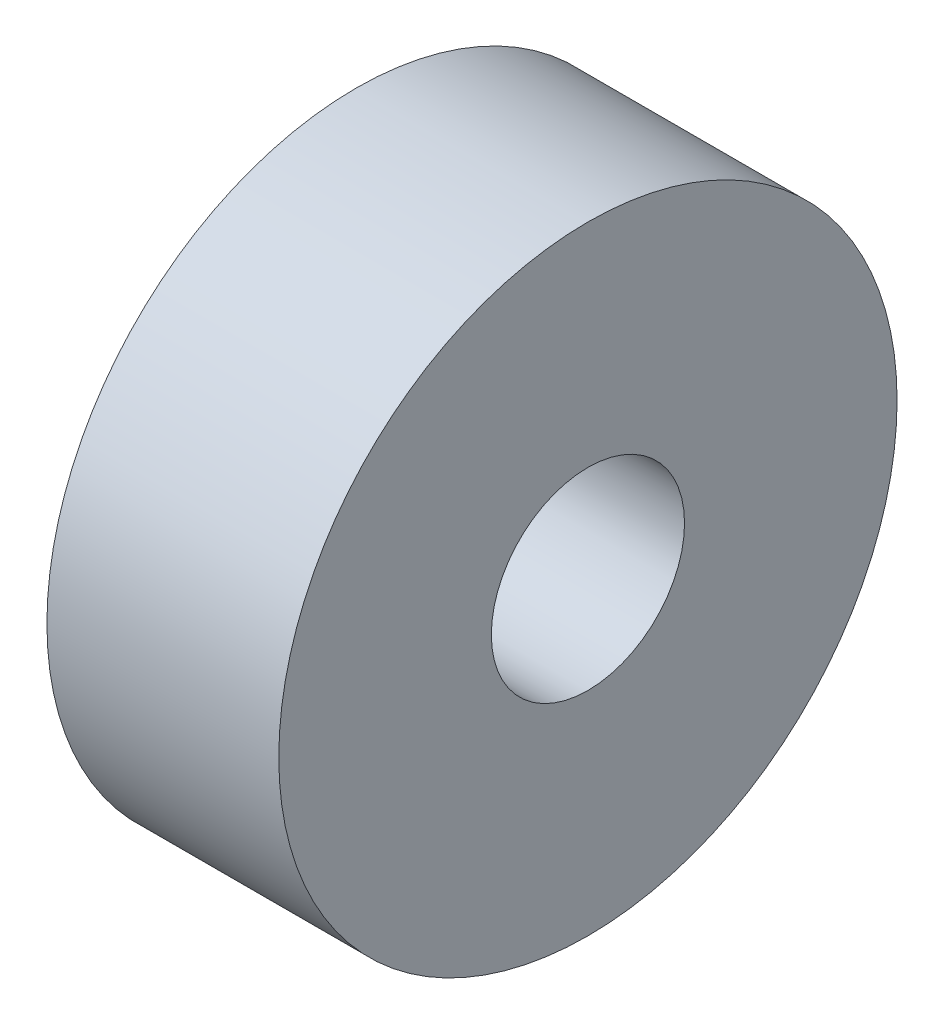
ISO-10303-21;
HEADER;
FILE_DESCRIPTION(('STEP AP214'),'2;1');
FILE_NAME('part.step','',(''),(''),'','','');
FILE_SCHEMA(('AUTOMOTIVE_DESIGN { 1 0 10303 214 1 1 1 1 }'));
ENDSEC;
DATA;
#1=APPLICATION_CONTEXT('core data for automotive mechanical design processes');
#2=APPLICATION_PROTOCOL_DEFINITION('international standard','automotive_design',2000,#1);
#3=PRODUCT_CONTEXT('',#1,'mechanical');
#4=PRODUCT('Part','Part','',(#3));
#5=PRODUCT_RELATED_PRODUCT_CATEGORY('part','',(#4));
#6=PRODUCT_DEFINITION_FORMATION('','',#4);
#7=PRODUCT_DEFINITION_CONTEXT('part definition',#1,'design');
#8=PRODUCT_DEFINITION('design','',#6,#7);
#9=PRODUCT_DEFINITION_SHAPE('','',#8);
#10=(LENGTH_UNIT() NAMED_UNIT(*) SI_UNIT(.MILLI.,.METRE.));
#11=(NAMED_UNIT(*) PLANE_ANGLE_UNIT() SI_UNIT($,.RADIAN.));
#12=(NAMED_UNIT(*) SI_UNIT($,.STERADIAN.) SOLID_ANGLE_UNIT());
#13=UNCERTAINTY_MEASURE_WITH_UNIT(LENGTH_MEASURE(1.E-05),#10,'distance_accuracy_value','');
#14=(GEOMETRIC_REPRESENTATION_CONTEXT(3) GLOBAL_UNCERTAINTY_ASSIGNED_CONTEXT((#13)) GLOBAL_UNIT_ASSIGNED_CONTEXT((#10,
#11,#12)) REPRESENTATION_CONTEXT('',''));
#15=CARTESIAN_POINT('',(0.,0.,0.));
#16=DIRECTION('',(0.,0.,1.));
#17=DIRECTION('',(1.,0.,0.));
#18=AXIS2_PLACEMENT_3D('',#15,#16,#17);
#19=CARTESIAN_POINT('',(3.,0.,0.));
#20=DIRECTION('',(1.,0.,0.));
#21=DIRECTION('',(0.,0.,-1.));
#22=AXIS2_PLACEMENT_3D('',#19,#20,#21);
#23=PLANE('',#22);
#24=CARTESIAN_POINT('',(3.,0.,0.));
#25=DIRECTION('',(1.,0.,0.));
#26=DIRECTION('',(0.,0.,-1.));
#27=AXIS2_PLACEMENT_3D('',#24,#25,#26);
#28=CIRCLE('',#27,4.);
#29=CARTESIAN_POINT('',(3.,0.,-4.));
#30=VERTEX_POINT('',#29);
#31=EDGE_CURVE('E10',#30,#30,#28,.T.);
#32=ORIENTED_EDGE('',*,*,#31,.T.);
#33=EDGE_LOOP('',(#32));
#34=FACE_BOUND('',#33,.T.);
#35=CARTESIAN_POINT('',(3.,0.,0.));
#36=DIRECTION('',(1.,0.,0.));
#37=DIRECTION('',(0.,0.,-1.));
#38=AXIS2_PLACEMENT_3D('',#35,#36,#37);
#39=CIRCLE('',#38,1.25);
#40=CARTESIAN_POINT('',(3.,0.,-1.25));
#41=VERTEX_POINT('',#40);
#42=EDGE_CURVE('E50',#41,#41,#39,.T.);
#43=ORIENTED_EDGE('',*,*,#42,.F.);
#44=EDGE_LOOP('',(#43));
#45=FACE_BOUND('',#44,.T.);
#46=ADVANCED_FACE('F39',(#34,#45),#23,.T.);
#47=CARTESIAN_POINT('',(0.,0.,0.));
#48=DIRECTION('',(1.,0.,0.));
#49=DIRECTION('',(0.,0.,-1.));
#50=AXIS2_PLACEMENT_3D('',#47,#48,#49);
#51=PLANE('',#50);
#52=CARTESIAN_POINT('',(0.,0.,0.));
#53=DIRECTION('',(1.,0.,0.));
#54=DIRECTION('',(0.,0.,-1.));
#55=AXIS2_PLACEMENT_3D('',#52,#53,#54);
#56=CIRCLE('',#55,4.);
#57=CARTESIAN_POINT('',(0.,0.,-4.));
#58=VERTEX_POINT('',#57);
#59=EDGE_CURVE('E43',#58,#58,#56,.T.);
#60=ORIENTED_EDGE('',*,*,#59,.F.);
#61=EDGE_LOOP('',(#60));
#62=FACE_BOUND('',#61,.T.);
#63=CARTESIAN_POINT('',(0.,0.,0.));
#64=DIRECTION('',(1.,0.,0.));
#65=DIRECTION('',(0.,0.,-1.));
#66=AXIS2_PLACEMENT_3D('',#63,#64,#65);
#67=CIRCLE('',#66,1.25);
#68=CARTESIAN_POINT('',(0.,0.,-1.25));
#69=VERTEX_POINT('',#68);
#70=EDGE_CURVE('E52',#69,#69,#67,.T.);
#71=ORIENTED_EDGE('',*,*,#70,.T.);
#72=EDGE_LOOP('',(#71));
#73=FACE_BOUND('',#72,.T.);
#74=ADVANCED_FACE('F62',(#62,#73),#51,.F.);
#75=CARTESIAN_POINT('',(3.,0.,0.));
#76=DIRECTION('',(-1.,0.,0.));
#77=DIRECTION('',(0.,0.,1.));
#78=AXIS2_PLACEMENT_3D('',#75,#76,#77);
#79=CYLINDRICAL_SURFACE('',#78,4.);
#80=ORIENTED_EDGE('',*,*,#31,.F.);
#81=EDGE_LOOP('',(#80));
#82=FACE_BOUND('',#81,.T.);
#83=ORIENTED_EDGE('',*,*,#59,.T.);
#84=EDGE_LOOP('',(#83));
#85=FACE_BOUND('',#84,.T.);
#86=ADVANCED_FACE('F41',(#82,#85),#79,.T.);
#87=CARTESIAN_POINT('',(3.,0.,0.));
#88=DIRECTION('',(-1.,0.,0.));
#89=DIRECTION('',(0.,0.,1.));
#90=AXIS2_PLACEMENT_3D('',#87,#88,#89);
#91=CYLINDRICAL_SURFACE('',#90,1.25);
#92=ORIENTED_EDGE('',*,*,#42,.T.);
#93=EDGE_LOOP('',(#92));
#94=FACE_BOUND('',#93,.T.);
#95=ORIENTED_EDGE('',*,*,#70,.F.);
#96=EDGE_LOOP('',(#95));
#97=FACE_BOUND('',#96,.T.);
#98=ADVANCED_FACE('F58',(#94,#97),#91,.F.);
#99=CLOSED_SHELL('',(#46,#74,#86,#98));
#100=MANIFOLD_SOLID_BREP('B2',#99);
#101=ADVANCED_BREP_SHAPE_REPRESENTATION('',(#18,#100),#14);
#102=SHAPE_DEFINITION_REPRESENTATION(#9,#101);
ENDSEC;
END-ISO-10303-21;
